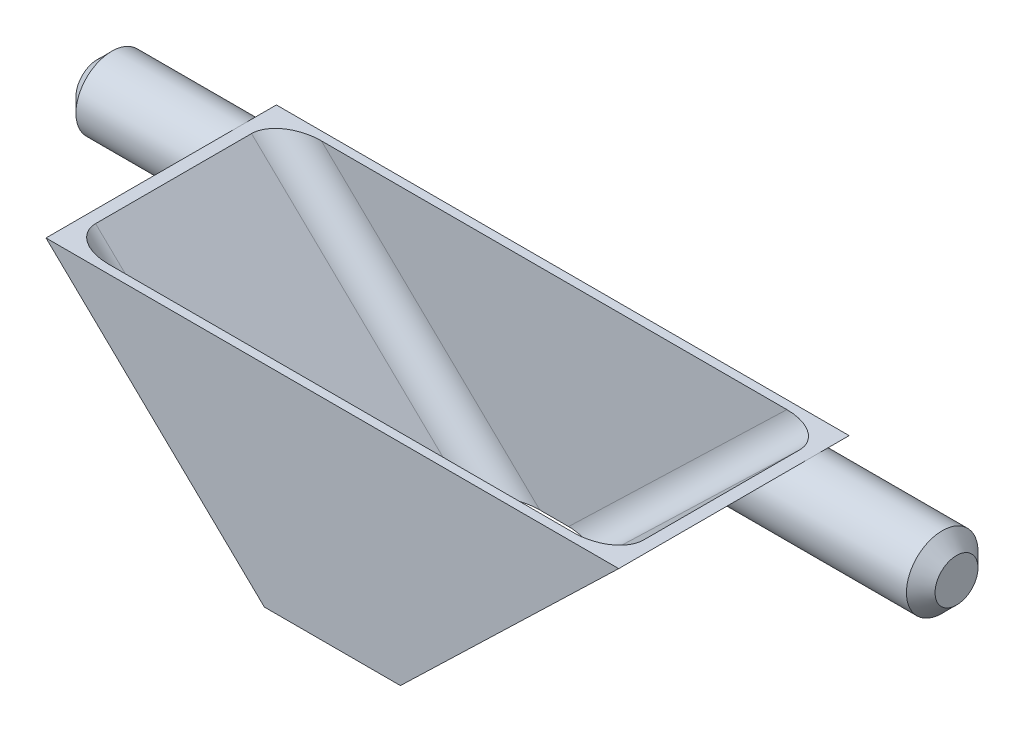
ISO-10303-21;
HEADER;
FILE_DESCRIPTION(('STEP AP214'),'2;1');
FILE_NAME('part.step','',(''),(''),'','','');
FILE_SCHEMA(('AUTOMOTIVE_DESIGN { 1 0 10303 214 1 1 1 1 }'));
ENDSEC;
DATA;
#1=APPLICATION_CONTEXT('core data for automotive mechanical design processes');
#2=APPLICATION_PROTOCOL_DEFINITION('international standard','automotive_design',2000,#1);
#3=PRODUCT_CONTEXT('',#1,'mechanical');
#4=PRODUCT('Part','Part','',(#3));
#5=PRODUCT_RELATED_PRODUCT_CATEGORY('part','',(#4));
#6=PRODUCT_DEFINITION_FORMATION('','',#4);
#7=PRODUCT_DEFINITION_CONTEXT('part definition',#1,'design');
#8=PRODUCT_DEFINITION('design','',#6,#7);
#9=PRODUCT_DEFINITION_SHAPE('','',#8);
#10=(LENGTH_UNIT() NAMED_UNIT(*) SI_UNIT(.MILLI.,.METRE.));
#11=(NAMED_UNIT(*) PLANE_ANGLE_UNIT() SI_UNIT($,.RADIAN.));
#12=(NAMED_UNIT(*) SI_UNIT($,.STERADIAN.) SOLID_ANGLE_UNIT());
#13=UNCERTAINTY_MEASURE_WITH_UNIT(LENGTH_MEASURE(1.E-05),#10,'distance_accuracy_value','');
#14=(GEOMETRIC_REPRESENTATION_CONTEXT(3) GLOBAL_UNCERTAINTY_ASSIGNED_CONTEXT((#13)) GLOBAL_UNIT_ASSIGNED_CONTEXT((#10,
#11,#12)) REPRESENTATION_CONTEXT('',''));
#15=CARTESIAN_POINT('',(0.,0.,0.));
#16=DIRECTION('',(0.,0.,1.));
#17=DIRECTION('',(1.,0.,0.));
#18=AXIS2_PLACEMENT_3D('',#15,#16,#17);
#19=CARTESIAN_POINT('',(-4.75,0.,16.09));
#20=DIRECTION('',(0.694004503560751,0.719970658455881,0.));
#21=DIRECTION('',(-0.719970658455881,0.694004503560751,0.));
#22=AXIS2_PLACEMENT_3D('',#19,#20,#21);
#23=PLANE('',#22);
#24=DIRECTION('',(0.,0.,-1.));
#25=VECTOR('',#24,1.);
#26=CARTESIAN_POINT('',(-20.,14.7,16.09));
#27=LINE('',#26,#25);
#28=CARTESIAN_POINT('',(-20.,14.7,16.09));
#29=VERTEX_POINT('',#28);
#30=CARTESIAN_POINT('',(-20.,14.7,2.5));
#31=VERTEX_POINT('',#30);
#32=EDGE_CURVE('E149',#29,#31,#27,.T.);
#33=ORIENTED_EDGE('',*,*,#32,.T.);
#34=CARTESIAN_POINT('',(-17.406462585034,12.2,2.5));
#35=DIRECTION('',(0.694004503560751,0.719970658455881,0.));
#36=DIRECTION('',(-0.719970658455881,0.694004503560751,0.));
#37=AXIS2_PLACEMENT_3D('',#34,#35,#36);
#38=ELLIPSE('',#37,3.6022820992849,2.5);
#39=CARTESIAN_POINT('',(-17.406462585034,12.2,0.));
#40=VERTEX_POINT('',#39);
#41=EDGE_CURVE('E49',#31,#40,#38,.T.);
#42=ORIENTED_EDGE('',*,*,#41,.T.);
#43=DIRECTION('',(0.719970658455881,-0.694004503560751,0.));
#44=VECTOR('',#43,1.);
#45=CARTESIAN_POINT('',(-4.75,0.,0.));
#46=LINE('',#45,#44);
#47=CARTESIAN_POINT('',(-4.75,0.,0.));
#48=VERTEX_POINT('',#47);
#49=EDGE_CURVE('E145',#40,#48,#46,.T.);
#50=ORIENTED_EDGE('',*,*,#49,.T.);
#51=DIRECTION('',(0.,0.,-1.));
#52=VECTOR('',#51,1.);
#53=CARTESIAN_POINT('',(-4.75,0.,16.09));
#54=LINE('',#53,#52);
#55=CARTESIAN_POINT('',(-4.75,0.,16.09));
#56=VERTEX_POINT('',#55);
#57=EDGE_CURVE('E171',#56,#48,#54,.T.);
#58=ORIENTED_EDGE('',*,*,#57,.F.);
#59=DIRECTION('',(0.719970658455881,-0.694004503560751,0.));
#60=VECTOR('',#59,1.);
#61=CARTESIAN_POINT('',(-4.75,0.,16.09));
#62=LINE('',#61,#60);
#63=EDGE_CURVE('E173',#29,#56,#62,.T.);
#64=ORIENTED_EDGE('',*,*,#63,.F.);
#65=EDGE_LOOP('',(#33,#42,#50,#58,#64));
#66=FACE_BOUND('',#65,.T.);
#67=ADVANCED_FACE('F35',(#66),#23,.F.);
#68=CARTESIAN_POINT('',(20.,14.7,16.09));
#69=DIRECTION('',(-0.694004503560751,0.719970658455881,0.));
#70=DIRECTION('',(-0.719970658455881,-0.694004503560751,0.));
#71=AXIS2_PLACEMENT_3D('',#68,#69,#70);
#72=PLANE('',#71);
#73=CARTESIAN_POINT('',(17.406462585034,12.2,2.5));
#74=DIRECTION('',(-0.694004503560751,0.719970658455881,0.));
#75=DIRECTION('',(0.719970658455881,0.694004503560751,0.));
#76=AXIS2_PLACEMENT_3D('',#73,#74,#75);
#77=ELLIPSE('',#76,3.60228209928491,2.5);
#78=CARTESIAN_POINT('',(20.,14.7,2.5));
#79=VERTEX_POINT('',#78);
#80=CARTESIAN_POINT('',(17.406462585034,12.2,0.));
#81=VERTEX_POINT('',#80);
#82=EDGE_CURVE('E150',#79,#81,#77,.F.);
#83=ORIENTED_EDGE('',*,*,#82,.F.);
#84=DIRECTION('',(0.,0.,-1.));
#85=VECTOR('',#84,1.);
#86=CARTESIAN_POINT('',(20.,14.7,16.09));
#87=LINE('',#86,#85);
#88=CARTESIAN_POINT('',(20.,14.7,16.09));
#89=VERTEX_POINT('',#88);
#90=EDGE_CURVE('E176',#89,#79,#87,.T.);
#91=ORIENTED_EDGE('',*,*,#90,.F.);
#92=DIRECTION('',(0.719970658455881,0.694004503560751,0.));
#93=VECTOR('',#92,1.);
#94=CARTESIAN_POINT('',(20.,14.7,16.09));
#95=LINE('',#94,#93);
#96=CARTESIAN_POINT('',(4.75,0.,16.09));
#97=VERTEX_POINT('',#96);
#98=EDGE_CURVE('E166',#97,#89,#95,.T.);
#99=ORIENTED_EDGE('',*,*,#98,.F.);
#100=DIRECTION('',(0.,0.,-1.));
#101=VECTOR('',#100,1.);
#102=CARTESIAN_POINT('',(4.75,0.,16.09));
#103=LINE('',#102,#101);
#104=CARTESIAN_POINT('',(4.75,0.,0.));
#105=VERTEX_POINT('',#104);
#106=EDGE_CURVE('E179',#97,#105,#103,.T.);
#107=ORIENTED_EDGE('',*,*,#106,.T.);
#108=DIRECTION('',(0.719970658455881,0.694004503560751,0.));
#109=VECTOR('',#108,1.);
#110=CARTESIAN_POINT('',(20.,14.7,0.));
#111=LINE('',#110,#109);
#112=EDGE_CURVE('E330',#105,#81,#111,.T.);
#113=ORIENTED_EDGE('',*,*,#112,.T.);
#114=EDGE_LOOP('',(#83,#91,#99,#107,#113));
#115=FACE_BOUND('',#114,.T.);
#116=ADVANCED_FACE('F237',(#115),#72,.F.);
#117=CARTESIAN_POINT('',(4.75,0.,16.09));
#118=DIRECTION('',(0.,1.,0.));
#119=DIRECTION('',(-1.,0.,0.));
#120=AXIS2_PLACEMENT_3D('',#117,#118,#119);
#121=PLANE('',#120);
#122=DIRECTION('',(1.,0.,0.));
#123=VECTOR('',#122,1.);
#124=CARTESIAN_POINT('',(4.75,0.,0.));
#125=LINE('',#124,#123);
#126=EDGE_CURVE('E158',#48,#105,#125,.T.);
#127=ORIENTED_EDGE('',*,*,#126,.T.);
#128=ORIENTED_EDGE('',*,*,#106,.F.);
#129=DIRECTION('',(1.,0.,0.));
#130=VECTOR('',#129,1.);
#131=CARTESIAN_POINT('',(4.75,0.,16.09));
#132=LINE('',#131,#130);
#133=EDGE_CURVE('E164',#56,#97,#132,.T.);
#134=ORIENTED_EDGE('',*,*,#133,.F.);
#135=ORIENTED_EDGE('',*,*,#57,.T.);
#136=EDGE_LOOP('',(#127,#128,#134,#135));
#137=FACE_BOUND('',#136,.T.);
#138=DIRECTION('',(1.,0.,0.));
#139=VECTOR('',#138,1.);
#140=CARTESIAN_POINT('',(0.,0.,0.6));
#141=LINE('',#140,#139);
#142=CARTESIAN_POINT('',(-1.0036266167437,0.,0.6));
#143=VERTEX_POINT('',#142);
#144=CARTESIAN_POINT('',(1.0036266167437,0.,0.6));
#145=VERTEX_POINT('',#144);
#146=EDGE_CURVE('E306',#143,#145,#141,.T.);
#147=ORIENTED_EDGE('',*,*,#146,.F.);
#148=CARTESIAN_POINT('',(-1.0036266167437,0.,2.6));
#149=DIRECTION('',(0.,1.,0.));
#150=DIRECTION('',(1.,0.,0.));
#151=AXIS2_PLACEMENT_3D('',#148,#149,#150);
#152=ELLIPSE('',#151,2.88182567942792,2.);
#153=CARTESIAN_POINT('',(-3.88545229617162,0.,2.6));
#154=VERTEX_POINT('',#153);
#155=EDGE_CURVE('E214',#143,#154,#152,.T.);
#156=ORIENTED_EDGE('',*,*,#155,.T.);
#157=DIRECTION('',(0.,0.,-1.));
#158=VECTOR('',#157,1.);
#159=CARTESIAN_POINT('',(-3.88545229617162,0.,16.09));
#160=LINE('',#159,#158);
#161=CARTESIAN_POINT('',(-3.88545229617162,0.,13.49));
#162=VERTEX_POINT('',#161);
#163=EDGE_CURVE('E317',#162,#154,#160,.T.);
#164=ORIENTED_EDGE('',*,*,#163,.F.);
#165=CARTESIAN_POINT('',(-1.0036266167437,0.,13.49));
#166=DIRECTION('',(0.,1.,0.));
#167=DIRECTION('',(-1.,0.,0.));
#168=AXIS2_PLACEMENT_3D('',#165,#166,#167);
#169=ELLIPSE('',#168,2.88182567942792,2.);
#170=CARTESIAN_POINT('',(-1.0036266167437,0.,15.49));
#171=VERTEX_POINT('',#170);
#172=EDGE_CURVE('E196',#162,#171,#169,.T.);
#173=ORIENTED_EDGE('',*,*,#172,.T.);
#174=DIRECTION('',(1.,0.,0.));
#175=VECTOR('',#174,1.);
#176=CARTESIAN_POINT('',(0.,0.,15.49));
#177=LINE('',#176,#175);
#178=CARTESIAN_POINT('',(1.0036266167437,0.,15.49));
#179=VERTEX_POINT('',#178);
#180=EDGE_CURVE('E305',#171,#179,#177,.T.);
#181=ORIENTED_EDGE('',*,*,#180,.T.);
#182=CARTESIAN_POINT('',(1.0036266167437,0.,13.49));
#183=DIRECTION('',(0.,1.,0.));
#184=DIRECTION('',(-1.,0.,0.));
#185=AXIS2_PLACEMENT_3D('',#182,#183,#184);
#186=ELLIPSE('',#185,2.88182567942792,2.);
#187=CARTESIAN_POINT('',(3.88545229617163,0.,13.49));
#188=VERTEX_POINT('',#187);
#189=EDGE_CURVE('E194',#179,#188,#186,.T.);
#190=ORIENTED_EDGE('',*,*,#189,.T.);
#191=DIRECTION('',(0.,0.,-1.));
#192=VECTOR('',#191,1.);
#193=CARTESIAN_POINT('',(3.88545229617163,0.,16.09));
#194=LINE('',#193,#192);
#195=CARTESIAN_POINT('',(3.88545229617163,0.,2.6));
#196=VERTEX_POINT('',#195);
#197=EDGE_CURVE('E320',#188,#196,#194,.T.);
#198=ORIENTED_EDGE('',*,*,#197,.T.);
#199=CARTESIAN_POINT('',(1.0036266167437,0.,2.6));
#200=DIRECTION('',(0.,1.,0.));
#201=DIRECTION('',(1.,0.,0.));
#202=AXIS2_PLACEMENT_3D('',#199,#200,#201);
#203=ELLIPSE('',#202,2.88182567942792,2.);
#204=EDGE_CURVE('E212',#196,#145,#203,.T.);
#205=ORIENTED_EDGE('',*,*,#204,.T.);
#206=EDGE_LOOP('',(#147,#156,#164,#173,#181,#190,#198,#205));
#207=FACE_BOUND('',#206,.T.);
#208=ADVANCED_FACE('F243',(#137,#207),#121,.F.);
#209=CARTESIAN_POINT('',(-20.,14.7,16.09));
#210=DIRECTION('',(0.,-1.,0.));
#211=DIRECTION('',(0.,0.,-1.));
#212=AXIS2_PLACEMENT_3D('',#209,#210,#211);
#213=PLANE('',#212);
#214=DIRECTION('',(-1.,0.,0.));
#215=VECTOR('',#214,1.);
#216=CARTESIAN_POINT('',(-20.,14.7,0.));
#217=LINE('',#216,#215);
#218=CARTESIAN_POINT('',(20.,14.7,0.));
#219=VERTEX_POINT('',#218);
#220=CARTESIAN_POINT('',(-20.,14.7,0.));
#221=VERTEX_POINT('',#220);
#222=EDGE_CURVE('E159',#219,#221,#217,.T.);
#223=ORIENTED_EDGE('',*,*,#222,.T.);
#224=EDGE_CURVE('E162',#31,#221,#27,.T.);
#225=ORIENTED_EDGE('',*,*,#224,.F.);
#226=ORIENTED_EDGE('',*,*,#32,.F.);
#227=DIRECTION('',(-1.,0.,0.));
#228=VECTOR('',#227,1.);
#229=CARTESIAN_POINT('',(-20.,14.7,16.09));
#230=LINE('',#229,#228);
#231=EDGE_CURVE('E326',#89,#29,#230,.T.);
#232=ORIENTED_EDGE('',*,*,#231,.F.);
#233=ORIENTED_EDGE('',*,*,#90,.T.);
#234=EDGE_CURVE('E175',#79,#219,#87,.T.);
#235=ORIENTED_EDGE('',*,*,#234,.T.);
#236=EDGE_LOOP('',(#223,#225,#226,#232,#233,#235));
#237=FACE_BOUND('',#236,.T.);
#238=DIRECTION('',(-1.,0.,0.));
#239=VECTOR('',#238,1.);
#240=CARTESIAN_POINT('',(0.,14.7,0.6));
#241=LINE('',#240,#239);
#242=CARTESIAN_POINT('',(16.2536266167437,14.7,0.6));
#243=VERTEX_POINT('',#242);
#244=CARTESIAN_POINT('',(-16.2536266167437,14.7,0.6));
#245=VERTEX_POINT('',#244);
#246=EDGE_CURVE('E298',#243,#245,#241,.T.);
#247=ORIENTED_EDGE('',*,*,#246,.F.);
#248=CARTESIAN_POINT('',(16.2536266167437,14.7,2.6));
#249=DIRECTION('',(0.,-1.,0.));
#250=DIRECTION('',(1.,0.,0.));
#251=AXIS2_PLACEMENT_3D('',#248,#249,#250);
#252=ELLIPSE('',#251,2.88182567942792,2.);
#253=CARTESIAN_POINT('',(19.1354522961716,14.7,2.6));
#254=VERTEX_POINT('',#253);
#255=EDGE_CURVE('E210',#243,#254,#252,.T.);
#256=ORIENTED_EDGE('',*,*,#255,.T.);
#257=DIRECTION('',(0.,0.,-1.));
#258=VECTOR('',#257,1.);
#259=CARTESIAN_POINT('',(19.1354522961716,14.7,16.09));
#260=LINE('',#259,#258);
#261=CARTESIAN_POINT('',(19.1354522961716,14.7,13.49));
#262=VERTEX_POINT('',#261);
#263=EDGE_CURVE('E314',#262,#254,#260,.T.);
#264=ORIENTED_EDGE('',*,*,#263,.F.);
#265=CARTESIAN_POINT('',(16.2536266167437,14.7,13.49));
#266=DIRECTION('',(0.,-1.,0.));
#267=DIRECTION('',(-1.,0.,0.));
#268=AXIS2_PLACEMENT_3D('',#265,#266,#267);
#269=ELLIPSE('',#268,2.88182567942792,2.);
#270=CARTESIAN_POINT('',(16.2536266167437,14.7,15.49));
#271=VERTEX_POINT('',#270);
#272=EDGE_CURVE('E192',#262,#271,#269,.T.);
#273=ORIENTED_EDGE('',*,*,#272,.T.);
#274=DIRECTION('',(-1.,0.,0.));
#275=VECTOR('',#274,1.);
#276=CARTESIAN_POINT('',(0.,14.7,15.49));
#277=LINE('',#276,#275);
#278=CARTESIAN_POINT('',(-16.2536266167437,14.7,15.49));
#279=VERTEX_POINT('',#278);
#280=EDGE_CURVE('E309',#271,#279,#277,.T.);
#281=ORIENTED_EDGE('',*,*,#280,.T.);
#282=CARTESIAN_POINT('',(-16.2536266167437,14.7,13.49));
#283=DIRECTION('',(0.,-1.,0.));
#284=DIRECTION('',(-1.,0.,0.));
#285=AXIS2_PLACEMENT_3D('',#282,#283,#284);
#286=ELLIPSE('',#285,2.88182567942792,2.);
#287=CARTESIAN_POINT('',(-19.1354522961716,14.7,13.49));
#288=VERTEX_POINT('',#287);
#289=EDGE_CURVE('E198',#279,#288,#286,.T.);
#290=ORIENTED_EDGE('',*,*,#289,.T.);
#291=DIRECTION('',(0.,0.,-1.));
#292=VECTOR('',#291,1.);
#293=CARTESIAN_POINT('',(-19.1354522961716,14.7,16.09));
#294=LINE('',#293,#292);
#295=CARTESIAN_POINT('',(-19.1354522961716,14.7,2.6));
#296=VERTEX_POINT('',#295);
#297=EDGE_CURVE('E300',#288,#296,#294,.T.);
#298=ORIENTED_EDGE('',*,*,#297,.T.);
#299=CARTESIAN_POINT('',(-16.2536266167437,14.7,2.6));
#300=DIRECTION('',(0.,-1.,0.));
#301=DIRECTION('',(1.,0.,0.));
#302=AXIS2_PLACEMENT_3D('',#299,#300,#301);
#303=ELLIPSE('',#302,2.88182567942792,2.);
#304=EDGE_CURVE('E216',#296,#245,#303,.T.);
#305=ORIENTED_EDGE('',*,*,#304,.T.);
#306=EDGE_LOOP('',(#247,#256,#264,#273,#281,#290,#298,#305));
#307=FACE_BOUND('',#306,.T.);
#308=ADVANCED_FACE('F259',(#237,#307),#213,.F.);
#309=EDGE_CURVE('E57',#81,#79,#77,.F.);
#310=ORIENTED_EDGE('',*,*,#309,.F.);
#311=EDGE_CURVE('E329',#81,#219,#111,.T.);
#312=ORIENTED_EDGE('',*,*,#311,.T.);
#313=ORIENTED_EDGE('',*,*,#234,.F.);
#314=EDGE_LOOP('',(#310,#312,#313));
#315=FACE_BOUND('',#314,.T.);
#316=ADVANCED_FACE('F246',(#315),#72,.F.);
#317=EDGE_CURVE('E156',#221,#40,#46,.T.);
#318=ORIENTED_EDGE('',*,*,#317,.T.);
#319=EDGE_CURVE('E134',#40,#31,#38,.T.);
#320=ORIENTED_EDGE('',*,*,#319,.T.);
#321=ORIENTED_EDGE('',*,*,#224,.T.);
#322=EDGE_LOOP('',(#318,#320,#321));
#323=FACE_BOUND('',#322,.T.);
#324=ADVANCED_FACE('F161',(#323),#23,.F.);
#325=CARTESIAN_POINT('',(0.,0.,16.09));
#326=DIRECTION('',(0.,0.,-1.));
#327=DIRECTION('',(-1.,0.,0.));
#328=AXIS2_PLACEMENT_3D('',#325,#326,#327);
#329=PLANE('',#328);
#330=ORIENTED_EDGE('',*,*,#133,.T.);
#331=ORIENTED_EDGE('',*,*,#98,.T.);
#332=ORIENTED_EDGE('',*,*,#231,.T.);
#333=ORIENTED_EDGE('',*,*,#63,.T.);
#334=EDGE_LOOP('',(#330,#331,#332,#333));
#335=FACE_BOUND('',#334,.T.);
#336=ADVANCED_FACE('F250',(#335),#329,.F.);
#337=CARTESIAN_POINT('',(0.,0.,0.));
#338=DIRECTION('',(0.,0.,-1.));
#339=DIRECTION('',(-1.,0.,0.));
#340=AXIS2_PLACEMENT_3D('',#337,#338,#339);
#341=PLANE('',#340);
#342=ORIENTED_EDGE('',*,*,#126,.F.);
#343=ORIENTED_EDGE('',*,*,#49,.F.);
#344=ORIENTED_EDGE('',*,*,#317,.F.);
#345=ORIENTED_EDGE('',*,*,#222,.F.);
#346=ORIENTED_EDGE('',*,*,#311,.F.);
#347=ORIENTED_EDGE('',*,*,#112,.F.);
#348=EDGE_LOOP('',(#342,#343,#344,#345,#346,#347));
#349=FACE_BOUND('',#348,.T.);
#350=ADVANCED_FACE('F154',(#349),#341,.T.);
#351=CARTESIAN_POINT('',(19.5835972978636,15.1319823950735,16.09));
#352=DIRECTION('',(-0.694004503560751,0.719970658455881,0.));
#353=DIRECTION('',(-0.719970658455881,-0.694004503560751,0.));
#354=AXIS2_PLACEMENT_3D('',#351,#352,#353);
#355=PLANE('',#354);
#356=ORIENTED_EDGE('',*,*,#263,.T.);
#357=DIRECTION('',(0.719970658455881,0.694004503560751,0.));
#358=VECTOR('',#357,1.);
#359=CARTESIAN_POINT('',(19.5835972978636,15.1319823950735,2.6));
#360=LINE('',#359,#358);
#361=EDGE_CURVE('E206',#254,#196,#360,.F.);
#362=ORIENTED_EDGE('',*,*,#361,.T.);
#363=ORIENTED_EDGE('',*,*,#197,.F.);
#364=DIRECTION('',(0.719970658455881,0.694004503560751,0.));
#365=VECTOR('',#364,1.);
#366=CARTESIAN_POINT('',(19.1354522961716,14.7,13.49));
#367=LINE('',#366,#365);
#368=EDGE_CURVE('E182',#188,#262,#367,.T.);
#369=ORIENTED_EDGE('',*,*,#368,.T.);
#370=EDGE_LOOP('',(#356,#362,#363,#369));
#371=FACE_BOUND('',#370,.T.);
#372=ADVANCED_FACE('F346',(#371),#355,.T.);
#373=CARTESIAN_POINT('',(-4.33359729786355,0.431982395073527,16.09));
#374=DIRECTION('',(0.694004503560751,0.719970658455881,0.));
#375=DIRECTION('',(-0.719970658455881,0.694004503560751,0.));
#376=AXIS2_PLACEMENT_3D('',#373,#374,#375);
#377=PLANE('',#376);
#378=ORIENTED_EDGE('',*,*,#163,.T.);
#379=DIRECTION('',(0.719970658455881,-0.694004503560751,0.));
#380=VECTOR('',#379,1.);
#381=CARTESIAN_POINT('',(-4.33359729786355,0.431982395073527,2.6));
#382=LINE('',#381,#380);
#383=EDGE_CURVE('E208',#154,#296,#382,.F.);
#384=ORIENTED_EDGE('',*,*,#383,.T.);
#385=ORIENTED_EDGE('',*,*,#297,.F.);
#386=DIRECTION('',(0.719970658455881,-0.694004503560751,0.));
#387=VECTOR('',#386,1.);
#388=CARTESIAN_POINT('',(-3.88545229617162,0.,13.49));
#389=LINE('',#388,#387);
#390=EDGE_CURVE('E189',#288,#162,#389,.T.);
#391=ORIENTED_EDGE('',*,*,#390,.T.);
#392=EDGE_LOOP('',(#378,#384,#385,#391));
#393=FACE_BOUND('',#392,.T.);
#394=ADVANCED_FACE('F359',(#393),#377,.T.);
#395=CARTESIAN_POINT('',(0.,0.,15.49));
#396=DIRECTION('',(0.,0.,-1.));
#397=DIRECTION('',(-1.,0.,0.));
#398=AXIS2_PLACEMENT_3D('',#395,#396,#397);
#399=PLANE('',#398);
#400=ORIENTED_EDGE('',*,*,#280,.F.);
#401=DIRECTION('',(0.719970658455881,0.694004503560751,0.));
#402=VECTOR('',#401,1.);
#403=CARTESIAN_POINT('',(2.49744328905012,1.43994131691176,15.49));
#404=LINE('',#403,#402);
#405=EDGE_CURVE('E187',#271,#179,#404,.F.);
#406=ORIENTED_EDGE('',*,*,#405,.T.);
#407=ORIENTED_EDGE('',*,*,#180,.F.);
#408=DIRECTION('',(0.719970658455881,-0.694004503560751,0.));
#409=VECTOR('',#408,1.);
#410=CARTESIAN_POINT('',(-17.7474432890501,16.1399413169118,15.49));
#411=LINE('',#410,#409);
#412=EDGE_CURVE('E185',#171,#279,#411,.F.);
#413=ORIENTED_EDGE('',*,*,#412,.T.);
#414=EDGE_LOOP('',(#400,#406,#407,#413));
#415=FACE_BOUND('',#414,.T.);
#416=ADVANCED_FACE('F354',(#415),#399,.T.);
#417=CARTESIAN_POINT('',(0.,0.,0.6));
#418=DIRECTION('',(0.,0.,-1.));
#419=DIRECTION('',(-1.,0.,0.));
#420=AXIS2_PLACEMENT_3D('',#417,#418,#419);
#421=PLANE('',#420);
#422=ORIENTED_EDGE('',*,*,#146,.T.);
#423=DIRECTION('',(0.719970658455881,0.694004503560751,0.));
#424=VECTOR('',#423,1.);
#425=CARTESIAN_POINT('',(0.48338898281442,-0.50147496516462,0.6));
#426=LINE('',#425,#424);
#427=EDGE_CURVE('E203',#145,#243,#426,.T.);
#428=ORIENTED_EDGE('',*,*,#427,.T.);
#429=ORIENTED_EDGE('',*,*,#246,.T.);
#430=DIRECTION('',(0.719970658455881,-0.694004503560751,0.));
#431=VECTOR('',#430,1.);
#432=CARTESIAN_POINT('',(-0.48338898281442,-0.50147496516462,0.6));
#433=LINE('',#432,#431);
#434=EDGE_CURVE('E200',#245,#143,#433,.T.);
#435=ORIENTED_EDGE('',*,*,#434,.T.);
#436=EDGE_LOOP('',(#422,#428,#429,#435));
#437=FACE_BOUND('',#436,.T.);
#438=ADVANCED_FACE('F272',(#437),#421,.F.);
#439=CARTESIAN_POINT('',(18.195588290742,16.5719237119853,13.49));
#440=DIRECTION('',(-0.719970658455881,-0.694004503560751,0.));
#441=DIRECTION('',(0.694004503560751,-0.719970658455881,0.));
#442=AXIS2_PLACEMENT_3D('',#439,#440,#441);
#443=CYLINDRICAL_SURFACE('',#442,2.);
#444=ORIENTED_EDGE('',*,*,#189,.F.);
#445=ORIENTED_EDGE('',*,*,#405,.F.);
#446=ORIENTED_EDGE('',*,*,#272,.F.);
#447=ORIENTED_EDGE('',*,*,#368,.F.);
#448=EDGE_LOOP('',(#444,#445,#446,#447));
#449=FACE_BOUND('',#448,.T.);
#450=ADVANCED_FACE('F268',(#449),#443,.F.);
#451=CARTESIAN_POINT('',(-2.94558829074205,1.87192371198529,13.49));
#452=DIRECTION('',(-0.719970658455881,0.694004503560751,0.));
#453=DIRECTION('',(-0.694004503560751,-0.719970658455881,0.));
#454=AXIS2_PLACEMENT_3D('',#451,#452,#453);
#455=CYLINDRICAL_SURFACE('',#454,2.);
#456=ORIENTED_EDGE('',*,*,#289,.F.);
#457=ORIENTED_EDGE('',*,*,#412,.F.);
#458=ORIENTED_EDGE('',*,*,#172,.F.);
#459=ORIENTED_EDGE('',*,*,#390,.F.);
#460=EDGE_LOOP('',(#456,#457,#458,#459));
#461=FACE_BOUND('',#460,.T.);
#462=ADVANCED_FACE('F271',(#461),#455,.F.);
#463=CARTESIAN_POINT('',(0.483388982814419,-0.501474965164619,2.6));
#464=DIRECTION('',(0.719970658455881,0.694004503560751,0.));
#465=DIRECTION('',(-0.694004503560751,0.719970658455881,0.));
#466=AXIS2_PLACEMENT_3D('',#463,#464,#465);
#467=CYLINDRICAL_SURFACE('',#466,2.);
#468=ORIENTED_EDGE('',*,*,#204,.F.);
#469=ORIENTED_EDGE('',*,*,#361,.F.);
#470=ORIENTED_EDGE('',*,*,#255,.F.);
#471=ORIENTED_EDGE('',*,*,#427,.F.);
#472=EDGE_LOOP('',(#468,#469,#470,#471));
#473=FACE_BOUND('',#472,.T.);
#474=ADVANCED_FACE('F276',(#473),#467,.F.);
#475=CARTESIAN_POINT('',(-0.48338898281442,-0.501474965164619,2.6));
#476=DIRECTION('',(0.719970658455881,-0.694004503560751,0.));
#477=DIRECTION('',(0.694004503560751,0.719970658455881,0.));
#478=AXIS2_PLACEMENT_3D('',#475,#476,#477);
#479=CYLINDRICAL_SURFACE('',#478,2.);
#480=ORIENTED_EDGE('',*,*,#304,.F.);
#481=ORIENTED_EDGE('',*,*,#383,.F.);
#482=ORIENTED_EDGE('',*,*,#155,.F.);
#483=ORIENTED_EDGE('',*,*,#434,.F.);
#484=EDGE_LOOP('',(#480,#481,#482,#483));
#485=FACE_BOUND('',#484,.T.);
#486=ADVANCED_FACE('F280',(#485),#479,.F.);
#487=CARTESIAN_POINT('',(-20.002,12.2,2.5));
#488=DIRECTION('',(1.,0.,0.));
#489=DIRECTION('',(0.,0.,-1.));
#490=AXIS2_PLACEMENT_3D('',#487,#488,#489);
#491=CYLINDRICAL_SURFACE('',#490,2.5);
#492=CARTESIAN_POINT('',(29.,12.2,2.5));
#493=DIRECTION('',(1.,0.,0.));
#494=DIRECTION('',(0.,0.,-1.));
#495=AXIS2_PLACEMENT_3D('',#492,#493,#494);
#496=CIRCLE('',#495,2.5);
#497=CARTESIAN_POINT('',(29.,12.2,0.));
#498=VERTEX_POINT('',#497);
#499=EDGE_CURVE('E11',#498,#498,#496,.F.);
#500=ORIENTED_EDGE('',*,*,#499,.T.);
#501=EDGE_LOOP('',(#500));
#502=FACE_BOUND('',#501,.T.);
#503=ORIENTED_EDGE('',*,*,#309,.T.);
#504=ORIENTED_EDGE('',*,*,#82,.T.);
#505=EDGE_LOOP('',(#503,#504));
#506=FACE_BOUND('',#505,.T.);
#507=ADVANCED_FACE('F283',(#502,#506),#491,.T.);
#508=CARTESIAN_POINT('',(30.,12.2,2.5));
#509=DIRECTION('',(1.,0.,0.));
#510=DIRECTION('',(0.,0.,-1.));
#511=AXIS2_PLACEMENT_3D('',#508,#509,#510);
#512=PLANE('',#511);
#513=CARTESIAN_POINT('',(30.,12.2,2.5));
#514=DIRECTION('',(1.,0.,0.));
#515=DIRECTION('',(0.,0.,-1.));
#516=AXIS2_PLACEMENT_3D('',#513,#514,#515);
#517=CIRCLE('',#516,1.49999999999999);
#518=CARTESIAN_POINT('',(30.,12.2,1.00000000000001));
#519=VERTEX_POINT('',#518);
#520=EDGE_CURVE('E43',#519,#519,#517,.T.);
#521=ORIENTED_EDGE('',*,*,#520,.T.);
#522=EDGE_LOOP('',(#521));
#523=FACE_BOUND('',#522,.T.);
#524=ADVANCED_FACE('F225',(#523),#512,.T.);
#525=CARTESIAN_POINT('',(30.002,12.2,2.5));
#526=DIRECTION('',(-1.,0.,0.));
#527=DIRECTION('',(0.,0.,1.));
#528=AXIS2_PLACEMENT_3D('',#525,#526,#527);
#529=CYLINDRICAL_SURFACE('',#528,2.5);
#530=CARTESIAN_POINT('',(-29.,12.2,2.5));
#531=DIRECTION('',(-1.,0.,0.));
#532=DIRECTION('',(0.,0.,1.));
#533=AXIS2_PLACEMENT_3D('',#530,#531,#532);
#534=CIRCLE('',#533,2.5);
#535=CARTESIAN_POINT('',(-29.,12.2,5.));
#536=VERTEX_POINT('',#535);
#537=EDGE_CURVE('E139',#536,#536,#534,.F.);
#538=ORIENTED_EDGE('',*,*,#537,.T.);
#539=EDGE_LOOP('',(#538));
#540=FACE_BOUND('',#539,.T.);
#541=ORIENTED_EDGE('',*,*,#41,.F.);
#542=ORIENTED_EDGE('',*,*,#319,.F.);
#543=EDGE_LOOP('',(#541,#542));
#544=FACE_BOUND('',#543,.T.);
#545=ADVANCED_FACE('F135',(#540,#544),#529,.T.);
#546=CARTESIAN_POINT('',(-30.,12.2,2.5));
#547=DIRECTION('',(-1.,0.,0.));
#548=DIRECTION('',(0.,0.,-1.));
#549=AXIS2_PLACEMENT_3D('',#546,#547,#548);
#550=PLANE('',#549);
#551=CARTESIAN_POINT('',(-30.,12.2,2.5));
#552=DIRECTION('',(-1.,0.,0.));
#553=DIRECTION('',(0.,0.,1.));
#554=AXIS2_PLACEMENT_3D('',#551,#552,#553);
#555=CIRCLE('',#554,1.49999999999998);
#556=CARTESIAN_POINT('',(-30.,12.2,3.99999999999998));
#557=VERTEX_POINT('',#556);
#558=EDGE_CURVE('E220',#557,#557,#555,.T.);
#559=ORIENTED_EDGE('',*,*,#558,.T.);
#560=EDGE_LOOP('',(#559));
#561=FACE_BOUND('',#560,.T.);
#562=ADVANCED_FACE('F233',(#561),#550,.T.);
#563=CARTESIAN_POINT('',(-29.,12.2,2.5));
#564=DIRECTION('',(1.,0.,0.));
#565=DIRECTION('',(0.,0.,-1.));
#566=AXIS2_PLACEMENT_3D('',#563,#564,#565);
#567=CONICAL_SURFACE('',#566,2.5,0.785398163397451);
#568=ORIENTED_EDGE('',*,*,#558,.F.);
#569=EDGE_LOOP('',(#568));
#570=FACE_BOUND('',#569,.T.);
#571=ORIENTED_EDGE('',*,*,#537,.F.);
#572=EDGE_LOOP('',(#571));
#573=FACE_BOUND('',#572,.T.);
#574=ADVANCED_FACE('F228',(#570,#573),#567,.T.);
#575=CARTESIAN_POINT('',(30.,12.2,2.5));
#576=DIRECTION('',(-1.,0.,0.));
#577=DIRECTION('',(0.,0.,1.));
#578=AXIS2_PLACEMENT_3D('',#575,#576,#577);
#579=CONICAL_SURFACE('',#578,1.49999999999999,0.785398163397447);
#580=ORIENTED_EDGE('',*,*,#499,.F.);
#581=EDGE_LOOP('',(#580));
#582=FACE_BOUND('',#581,.T.);
#583=ORIENTED_EDGE('',*,*,#520,.F.);
#584=EDGE_LOOP('',(#583));
#585=FACE_BOUND('',#584,.T.);
#586=ADVANCED_FACE('F37',(#582,#585),#579,.T.);
#587=CLOSED_SHELL('',(#67,#116,#208,#308,#316,#324,#336,#350,#372,#394,#416,#438,#450,#462,#474,
#486,#507,#524,#545,#562,#574,#586));
#588=MANIFOLD_SOLID_BREP('B2',#587);
#589=ADVANCED_BREP_SHAPE_REPRESENTATION('',(#18,#588),#14);
#590=SHAPE_DEFINITION_REPRESENTATION(#9,#589);
ENDSEC;
END-ISO-10303-21;
